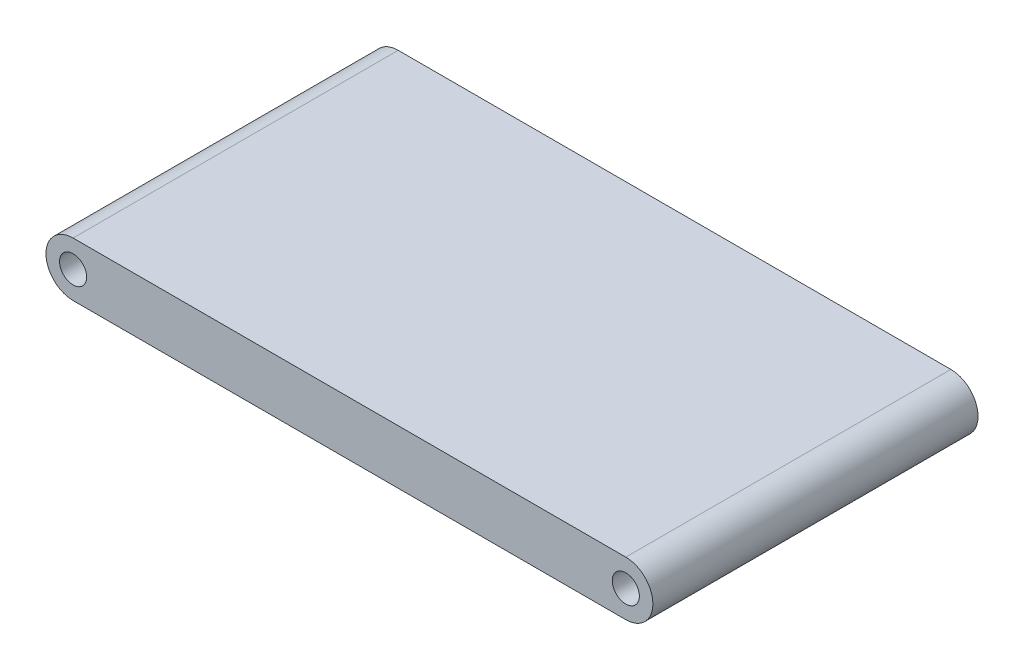
ISO-10303-21;
HEADER;
FILE_DESCRIPTION(('STEP AP214'),'2;1');
FILE_NAME('part.step','',(''),(''),'','','');
FILE_SCHEMA(('AUTOMOTIVE_DESIGN { 1 0 10303 214 1 1 1 1 }'));
ENDSEC;
DATA;
#1=APPLICATION_CONTEXT('core data for automotive mechanical design processes');
#2=APPLICATION_PROTOCOL_DEFINITION('international standard','automotive_design',2000,#1);
#3=PRODUCT_CONTEXT('',#1,'mechanical');
#4=PRODUCT('Part','Part','',(#3));
#5=PRODUCT_RELATED_PRODUCT_CATEGORY('part','',(#4));
#6=PRODUCT_DEFINITION_FORMATION('','',#4);
#7=PRODUCT_DEFINITION_CONTEXT('part definition',#1,'design');
#8=PRODUCT_DEFINITION('design','',#6,#7);
#9=PRODUCT_DEFINITION_SHAPE('','',#8);
#10=(LENGTH_UNIT() NAMED_UNIT(*) SI_UNIT(.MILLI.,.METRE.));
#11=(NAMED_UNIT(*) PLANE_ANGLE_UNIT() SI_UNIT($,.RADIAN.));
#12=(NAMED_UNIT(*) SI_UNIT($,.STERADIAN.) SOLID_ANGLE_UNIT());
#13=UNCERTAINTY_MEASURE_WITH_UNIT(LENGTH_MEASURE(1.E-05),#10,'distance_accuracy_value','');
#14=(GEOMETRIC_REPRESENTATION_CONTEXT(3) GLOBAL_UNCERTAINTY_ASSIGNED_CONTEXT((#13)) GLOBAL_UNIT_ASSIGNED_CONTEXT((#10,
#11,#12)) REPRESENTATION_CONTEXT('',''));
#15=CARTESIAN_POINT('',(0.,0.,0.));
#16=DIRECTION('',(0.,0.,1.));
#17=DIRECTION('',(1.,0.,0.));
#18=AXIS2_PLACEMENT_3D('',#15,#16,#17);
#19=CARTESIAN_POINT('',(0.,0.,76.2));
#20=DIRECTION('',(0.,0.,1.));
#21=DIRECTION('',(1.,0.,0.));
#22=AXIS2_PLACEMENT_3D('',#19,#20,#21);
#23=PLANE('',#22);
#24=CARTESIAN_POINT('',(0.,0.,76.2));
#25=DIRECTION('',(0.,0.,1.));
#26=DIRECTION('',(1.,0.,0.));
#27=AXIS2_PLACEMENT_3D('',#24,#25,#26);
#28=CIRCLE('',#27,3.175);
#29=CARTESIAN_POINT('',(3.175,0.,76.2));
#30=VERTEX_POINT('',#29);
#31=EDGE_CURVE('E118',#30,#30,#28,.T.);
#32=ORIENTED_EDGE('',*,*,#31,.F.);
#33=EDGE_LOOP('',(#32));
#34=FACE_BOUND('',#33,.T.);
#35=CARTESIAN_POINT('',(0.,0.,76.2));
#36=DIRECTION('',(0.,0.,1.));
#37=DIRECTION('',(1.,0.,0.));
#38=AXIS2_PLACEMENT_3D('',#35,#36,#37);
#39=CIRCLE('',#38,6.35);
#40=CARTESIAN_POINT('',(0.,6.35,76.2));
#41=VERTEX_POINT('',#40);
#42=CARTESIAN_POINT('',(0.,-6.35,76.2));
#43=VERTEX_POINT('',#42);
#44=EDGE_CURVE('E98',#41,#43,#39,.T.);
#45=ORIENTED_EDGE('',*,*,#44,.T.);
#46=DIRECTION('',(1.,0.,0.));
#47=VECTOR('',#46,1.);
#48=CARTESIAN_POINT('',(0.,-6.35,76.2));
#49=LINE('',#48,#47);
#50=CARTESIAN_POINT('',(129.54,-6.35,76.2));
#51=VERTEX_POINT('',#50);
#52=EDGE_CURVE('E93',#43,#51,#49,.T.);
#53=ORIENTED_EDGE('',*,*,#52,.T.);
#54=CARTESIAN_POINT('',(129.54,0.,76.2));
#55=DIRECTION('',(0.,0.,1.));
#56=DIRECTION('',(-1.,0.,0.));
#57=AXIS2_PLACEMENT_3D('',#54,#55,#56);
#58=CIRCLE('',#57,6.35);
#59=CARTESIAN_POINT('',(129.54,6.35,76.2));
#60=VERTEX_POINT('',#59);
#61=EDGE_CURVE('E96',#51,#60,#58,.T.);
#62=ORIENTED_EDGE('',*,*,#61,.T.);
#63=DIRECTION('',(-1.,0.,0.));
#64=VECTOR('',#63,1.);
#65=CARTESIAN_POINT('',(0.,6.35,76.2));
#66=LINE('',#65,#64);
#67=EDGE_CURVE('E63',#60,#41,#66,.T.);
#68=ORIENTED_EDGE('',*,*,#67,.T.);
#69=EDGE_LOOP('',(#45,#53,#62,#68));
#70=FACE_BOUND('',#69,.T.);
#71=CARTESIAN_POINT('',(129.54,0.,76.2));
#72=DIRECTION('',(0.,0.,1.));
#73=DIRECTION('',(1.,0.,0.));
#74=AXIS2_PLACEMENT_3D('',#71,#72,#73);
#75=CIRCLE('',#74,3.175);
#76=CARTESIAN_POINT('',(132.715,0.,76.2));
#77=VERTEX_POINT('',#76);
#78=EDGE_CURVE('E140',#77,#77,#75,.T.);
#79=ORIENTED_EDGE('',*,*,#78,.F.);
#80=EDGE_LOOP('',(#79));
#81=FACE_BOUND('',#80,.T.);
#82=ADVANCED_FACE('F45',(#34,#70,#81),#23,.T.);
#83=CARTESIAN_POINT('',(0.,0.,0.));
#84=DIRECTION('',(0.,0.,1.));
#85=DIRECTION('',(1.,0.,0.));
#86=AXIS2_PLACEMENT_3D('',#83,#84,#85);
#87=PLANE('',#86);
#88=CARTESIAN_POINT('',(0.,0.,0.));
#89=DIRECTION('',(0.,0.,1.));
#90=DIRECTION('',(1.,0.,0.));
#91=AXIS2_PLACEMENT_3D('',#88,#89,#90);
#92=CIRCLE('',#91,6.35);
#93=CARTESIAN_POINT('',(0.,6.35,0.));
#94=VERTEX_POINT('',#93);
#95=CARTESIAN_POINT('',(0.,-6.35,0.));
#96=VERTEX_POINT('',#95);
#97=EDGE_CURVE('E114',#94,#96,#92,.T.);
#98=ORIENTED_EDGE('',*,*,#97,.F.);
#99=DIRECTION('',(-1.,0.,0.));
#100=VECTOR('',#99,1.);
#101=CARTESIAN_POINT('',(0.,6.35,0.));
#102=LINE('',#101,#100);
#103=CARTESIAN_POINT('',(129.54,6.35,0.));
#104=VERTEX_POINT('',#103);
#105=EDGE_CURVE('E86',#104,#94,#102,.T.);
#106=ORIENTED_EDGE('',*,*,#105,.F.);
#107=CARTESIAN_POINT('',(129.54,0.,0.));
#108=DIRECTION('',(0.,0.,1.));
#109=DIRECTION('',(-1.,0.,0.));
#110=AXIS2_PLACEMENT_3D('',#107,#108,#109);
#111=CIRCLE('',#110,6.35);
#112=CARTESIAN_POINT('',(129.54,-6.35,0.));
#113=VERTEX_POINT('',#112);
#114=EDGE_CURVE('E80',#113,#104,#111,.T.);
#115=ORIENTED_EDGE('',*,*,#114,.F.);
#116=DIRECTION('',(1.,0.,0.));
#117=VECTOR('',#116,1.);
#118=CARTESIAN_POINT('',(0.,-6.35,0.));
#119=LINE('',#118,#117);
#120=EDGE_CURVE('E103',#96,#113,#119,.T.);
#121=ORIENTED_EDGE('',*,*,#120,.F.);
#122=EDGE_LOOP('',(#98,#106,#115,#121));
#123=FACE_BOUND('',#122,.T.);
#124=CARTESIAN_POINT('',(0.,0.,0.));
#125=DIRECTION('',(0.,0.,1.));
#126=DIRECTION('',(1.,0.,0.));
#127=AXIS2_PLACEMENT_3D('',#124,#125,#126);
#128=CIRCLE('',#127,3.175);
#129=CARTESIAN_POINT('',(3.175,0.,0.));
#130=VERTEX_POINT('',#129);
#131=EDGE_CURVE('E136',#130,#130,#128,.T.);
#132=ORIENTED_EDGE('',*,*,#131,.T.);
#133=EDGE_LOOP('',(#132));
#134=FACE_BOUND('',#133,.T.);
#135=CARTESIAN_POINT('',(129.54,0.,0.));
#136=DIRECTION('',(0.,0.,1.));
#137=DIRECTION('',(1.,0.,0.));
#138=AXIS2_PLACEMENT_3D('',#135,#136,#137);
#139=CIRCLE('',#138,3.175);
#140=CARTESIAN_POINT('',(132.715,0.,0.));
#141=VERTEX_POINT('',#140);
#142=EDGE_CURVE('E144',#141,#141,#139,.T.);
#143=ORIENTED_EDGE('',*,*,#142,.T.);
#144=EDGE_LOOP('',(#143));
#145=FACE_BOUND('',#144,.T.);
#146=ADVANCED_FACE('F131',(#123,#134,#145),#87,.F.);
#147=CARTESIAN_POINT('',(0.,0.,76.2));
#148=DIRECTION('',(0.,0.,-1.));
#149=DIRECTION('',(-1.,0.,0.));
#150=AXIS2_PLACEMENT_3D('',#147,#148,#149);
#151=CYLINDRICAL_SURFACE('',#150,6.35);
#152=ORIENTED_EDGE('',*,*,#97,.T.);
#153=DIRECTION('',(0.,0.,-1.));
#154=VECTOR('',#153,1.);
#155=CARTESIAN_POINT('',(0.,-6.35,76.2));
#156=LINE('',#155,#154);
#157=EDGE_CURVE('E11',#43,#96,#156,.T.);
#158=ORIENTED_EDGE('',*,*,#157,.F.);
#159=ORIENTED_EDGE('',*,*,#44,.F.);
#160=DIRECTION('',(0.,0.,-1.));
#161=VECTOR('',#160,1.);
#162=CARTESIAN_POINT('',(0.,6.35,76.2));
#163=LINE('',#162,#161);
#164=EDGE_CURVE('E110',#41,#94,#163,.T.);
#165=ORIENTED_EDGE('',*,*,#164,.T.);
#166=EDGE_LOOP('',(#152,#158,#159,#165));
#167=FACE_BOUND('',#166,.T.);
#168=ADVANCED_FACE('F47',(#167),#151,.T.);
#169=CARTESIAN_POINT('',(0.,-6.35,76.2));
#170=DIRECTION('',(0.,1.,0.));
#171=DIRECTION('',(-1.,0.,0.));
#172=AXIS2_PLACEMENT_3D('',#169,#170,#171);
#173=PLANE('',#172);
#174=ORIENTED_EDGE('',*,*,#120,.T.);
#175=DIRECTION('',(0.,0.,-1.));
#176=VECTOR('',#175,1.);
#177=CARTESIAN_POINT('',(129.54,-6.35,76.2));
#178=LINE('',#177,#176);
#179=EDGE_CURVE('E55',#51,#113,#178,.T.);
#180=ORIENTED_EDGE('',*,*,#179,.F.);
#181=ORIENTED_EDGE('',*,*,#52,.F.);
#182=ORIENTED_EDGE('',*,*,#157,.T.);
#183=EDGE_LOOP('',(#174,#180,#181,#182));
#184=FACE_BOUND('',#183,.T.);
#185=ADVANCED_FACE('F102',(#184),#173,.F.);
#186=CARTESIAN_POINT('',(129.54,0.,76.2));
#187=DIRECTION('',(0.,0.,-1.));
#188=DIRECTION('',(-1.,0.,0.));
#189=AXIS2_PLACEMENT_3D('',#186,#187,#188);
#190=CYLINDRICAL_SURFACE('',#189,6.35);
#191=ORIENTED_EDGE('',*,*,#114,.T.);
#192=DIRECTION('',(0.,0.,-1.));
#193=VECTOR('',#192,1.);
#194=CARTESIAN_POINT('',(129.54,6.35,76.2));
#195=LINE('',#194,#193);
#196=EDGE_CURVE('E105',#60,#104,#195,.T.);
#197=ORIENTED_EDGE('',*,*,#196,.F.);
#198=ORIENTED_EDGE('',*,*,#61,.F.);
#199=ORIENTED_EDGE('',*,*,#179,.T.);
#200=EDGE_LOOP('',(#191,#197,#198,#199));
#201=FACE_BOUND('',#200,.T.);
#202=ADVANCED_FACE('F106',(#201),#190,.T.);
#203=CARTESIAN_POINT('',(0.,6.35,76.2));
#204=DIRECTION('',(0.,-1.,0.));
#205=DIRECTION('',(0.,0.,-1.));
#206=AXIS2_PLACEMENT_3D('',#203,#204,#205);
#207=PLANE('',#206);
#208=ORIENTED_EDGE('',*,*,#105,.T.);
#209=ORIENTED_EDGE('',*,*,#164,.F.);
#210=ORIENTED_EDGE('',*,*,#67,.F.);
#211=ORIENTED_EDGE('',*,*,#196,.T.);
#212=EDGE_LOOP('',(#208,#209,#210,#211));
#213=FACE_BOUND('',#212,.T.);
#214=ADVANCED_FACE('F128',(#213),#207,.F.);
#215=CARTESIAN_POINT('',(0.,0.,76.2));
#216=DIRECTION('',(0.,0.,-1.));
#217=DIRECTION('',(-1.,0.,0.));
#218=AXIS2_PLACEMENT_3D('',#215,#216,#217);
#219=CYLINDRICAL_SURFACE('',#218,3.175);
#220=ORIENTED_EDGE('',*,*,#31,.T.);
#221=EDGE_LOOP('',(#220));
#222=FACE_BOUND('',#221,.T.);
#223=ORIENTED_EDGE('',*,*,#131,.F.);
#224=EDGE_LOOP('',(#223));
#225=FACE_BOUND('',#224,.T.);
#226=ADVANCED_FACE('F163',(#222,#225),#219,.F.);
#227=CARTESIAN_POINT('',(129.54,0.,76.2));
#228=DIRECTION('',(0.,0.,-1.));
#229=DIRECTION('',(-1.,0.,0.));
#230=AXIS2_PLACEMENT_3D('',#227,#228,#229);
#231=CYLINDRICAL_SURFACE('',#230,3.175);
#232=ORIENTED_EDGE('',*,*,#78,.T.);
#233=EDGE_LOOP('',(#232));
#234=FACE_BOUND('',#233,.T.);
#235=ORIENTED_EDGE('',*,*,#142,.F.);
#236=EDGE_LOOP('',(#235));
#237=FACE_BOUND('',#236,.T.);
#238=ADVANCED_FACE('F152',(#234,#237),#231,.F.);
#239=CLOSED_SHELL('',(#82,#146,#168,#185,#202,#214,#226,#238));
#240=MANIFOLD_SOLID_BREP('B2',#239);
#241=ADVANCED_BREP_SHAPE_REPRESENTATION('',(#18,#240),#14);
#242=SHAPE_DEFINITION_REPRESENTATION(#9,#241);
ENDSEC;
END-ISO-10303-21;
